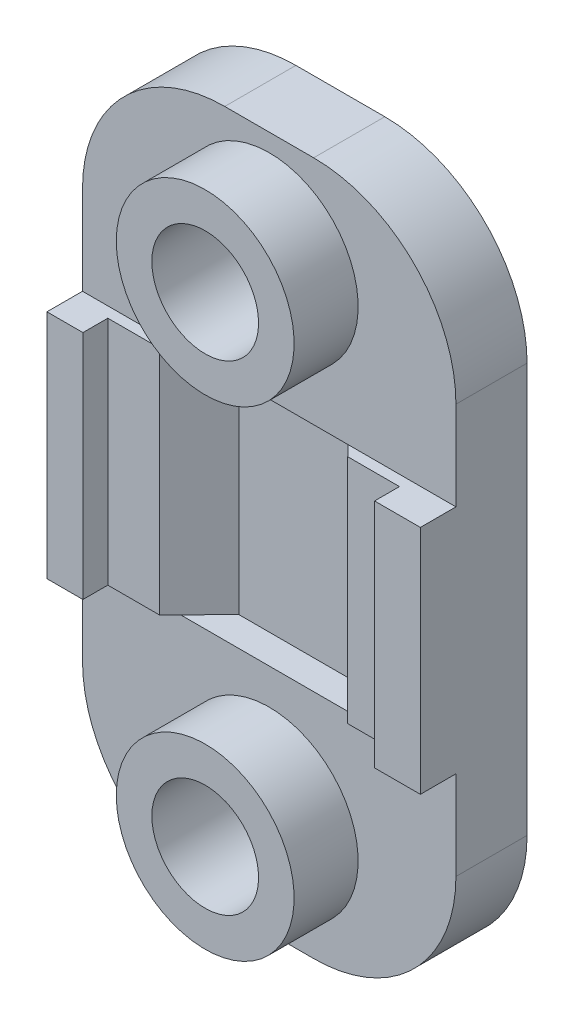
ISO-10303-21;
HEADER;
FILE_DESCRIPTION(('STEP AP214'),'2;1');
FILE_NAME('part.step','',(''),(''),'','','');
FILE_SCHEMA(('AUTOMOTIVE_DESIGN { 1 0 10303 214 1 1 1 1 }'));
ENDSEC;
DATA;
#1=APPLICATION_CONTEXT('core data for automotive mechanical design processes');
#2=APPLICATION_PROTOCOL_DEFINITION('international standard','automotive_design',2000,#1);
#3=PRODUCT_CONTEXT('',#1,'mechanical');
#4=PRODUCT('Part','Part','',(#3));
#5=PRODUCT_RELATED_PRODUCT_CATEGORY('part','',(#4));
#6=PRODUCT_DEFINITION_FORMATION('','',#4);
#7=PRODUCT_DEFINITION_CONTEXT('part definition',#1,'design');
#8=PRODUCT_DEFINITION('design','',#6,#7);
#9=PRODUCT_DEFINITION_SHAPE('','',#8);
#10=(LENGTH_UNIT() NAMED_UNIT(*) SI_UNIT(.MILLI.,.METRE.));
#11=(NAMED_UNIT(*) PLANE_ANGLE_UNIT() SI_UNIT($,.RADIAN.));
#12=(NAMED_UNIT(*) SI_UNIT($,.STERADIAN.) SOLID_ANGLE_UNIT());
#13=UNCERTAINTY_MEASURE_WITH_UNIT(LENGTH_MEASURE(1.E-05),#10,'distance_accuracy_value','');
#14=(GEOMETRIC_REPRESENTATION_CONTEXT(3) GLOBAL_UNCERTAINTY_ASSIGNED_CONTEXT((#13)) GLOBAL_UNIT_ASSIGNED_CONTEXT((#10,
#11,#12)) REPRESENTATION_CONTEXT('',''));
#15=CARTESIAN_POINT('',(0.,0.,0.));
#16=DIRECTION('',(0.,0.,1.));
#17=DIRECTION('',(1.,0.,0.));
#18=AXIS2_PLACEMENT_3D('',#15,#16,#17);
#19=CARTESIAN_POINT('',(0.,13.,0.));
#20=DIRECTION('',(0.,-1.,0.));
#21=DIRECTION('',(0.,0.,-1.));
#22=AXIS2_PLACEMENT_3D('',#19,#20,#21);
#23=PLANE('',#22);
#24=DIRECTION('',(1.,0.,0.));
#25=VECTOR('',#24,1.);
#26=CARTESIAN_POINT('',(0.,13.,0.));
#27=LINE('',#26,#25);
#28=CARTESIAN_POINT('',(-10.5,13.,0.));
#29=VERTEX_POINT('',#28);
#30=CARTESIAN_POINT('',(-4.97955941976815,13.,0.));
#31=VERTEX_POINT('',#30);
#32=EDGE_CURVE('E277',#29,#31,#27,.T.);
#33=ORIENTED_EDGE('',*,*,#32,.F.);
#34=DIRECTION('',(0.,0.,1.));
#35=VECTOR('',#34,1.);
#36=CARTESIAN_POINT('',(-10.5,13.,2.));
#37=LINE('',#36,#35);
#38=CARTESIAN_POINT('',(-10.5,13.,2.));
#39=VERTEX_POINT('',#38);
#40=EDGE_CURVE('E307',#29,#39,#37,.T.);
#41=ORIENTED_EDGE('',*,*,#40,.T.);
#42=DIRECTION('',(1.,0.,0.));
#43=VECTOR('',#42,1.);
#44=CARTESIAN_POINT('',(-8.47617523550108,13.,2.));
#45=LINE('',#44,#43);
#46=CARTESIAN_POINT('',(-8.47617523550108,13.,2.));
#47=VERTEX_POINT('',#46);
#48=EDGE_CURVE('E310',#39,#47,#45,.T.);
#49=ORIENTED_EDGE('',*,*,#48,.T.);
#50=DIRECTION('',(0.,0.,-1.));
#51=VECTOR('',#50,1.);
#52=CARTESIAN_POINT('',(-8.47617523550108,13.,0.599999999999971));
#53=LINE('',#52,#51);
#54=CARTESIAN_POINT('',(-8.47617523550108,13.,0.599999999999971));
#55=VERTEX_POINT('',#54);
#56=EDGE_CURVE('E313',#47,#55,#53,.T.);
#57=ORIENTED_EDGE('',*,*,#56,.T.);
#58=DIRECTION('',(1.,0.,0.));
#59=VECTOR('',#58,1.);
#60=CARTESIAN_POINT('',(-5.56844830865702,13.,0.599999999999971));
#61=LINE('',#60,#59);
#62=CARTESIAN_POINT('',(-5.56844830865702,13.,0.599999999999971));
#63=VERTEX_POINT('',#62);
#64=EDGE_CURVE('E316',#55,#63,#61,.T.);
#65=ORIENTED_EDGE('',*,*,#64,.T.);
#66=DIRECTION('',(0.700467716482401,0.,-0.713684088491491));
#67=VECTOR('',#66,1.);
#68=CARTESIAN_POINT('',(-3.36011497532369,13.,-1.64999999999999));
#69=LINE('',#68,#67);
#70=EDGE_CURVE('E320',#63,#31,#69,.T.);
#71=ORIENTED_EDGE('',*,*,#70,.T.);
#72=EDGE_LOOP('',(#33,#41,#49,#57,#65,#71));
#73=FACE_BOUND('',#72,.T.);
#74=ADVANCED_FACE('F59',(#73),#23,.F.);
#75=CARTESIAN_POINT('',(4.42720894876601,13.,0.));
#76=VERTEX_POINT('',#75);
#77=CARTESIAN_POINT('',(10.5,13.,0.));
#78=VERTEX_POINT('',#77);
#79=EDGE_CURVE('E235',#76,#78,#27,.T.);
#80=ORIENTED_EDGE('',*,*,#79,.F.);
#81=DIRECTION('',(0.700467716482409,0.,0.713684088491483));
#82=VECTOR('',#81,1.);
#83=CARTESIAN_POINT('',(5.01609783765481,13.,0.599999999999881));
#84=LINE('',#83,#82);
#85=CARTESIAN_POINT('',(5.01609783765481,13.,0.599999999999881));
#86=VERTEX_POINT('',#85);
#87=EDGE_CURVE('E328',#76,#86,#84,.T.);
#88=ORIENTED_EDGE('',*,*,#87,.T.);
#89=DIRECTION('',(1.,0.,0.));
#90=VECTOR('',#89,1.);
#91=CARTESIAN_POINT('',(7.9238247644989,13.,0.599999999999881));
#92=LINE('',#91,#90);
#93=CARTESIAN_POINT('',(7.9238247644989,13.,0.599999999999881));
#94=VERTEX_POINT('',#93);
#95=EDGE_CURVE('E333',#86,#94,#92,.T.);
#96=ORIENTED_EDGE('',*,*,#95,.T.);
#97=DIRECTION('',(0.,0.,1.));
#98=VECTOR('',#97,1.);
#99=CARTESIAN_POINT('',(7.9238247644989,13.,1.99999999999986));
#100=LINE('',#99,#98);
#101=CARTESIAN_POINT('',(7.9238247644989,13.,1.99999999999986));
#102=VERTEX_POINT('',#101);
#103=EDGE_CURVE('E336',#94,#102,#100,.T.);
#104=ORIENTED_EDGE('',*,*,#103,.T.);
#105=DIRECTION('',(1.,0.,0.));
#106=VECTOR('',#105,1.);
#107=CARTESIAN_POINT('',(10.5,13.,1.99999999999986));
#108=LINE('',#107,#106);
#109=CARTESIAN_POINT('',(10.5,13.,1.99999999999986));
#110=VERTEX_POINT('',#109);
#111=EDGE_CURVE('E299',#102,#110,#108,.T.);
#112=ORIENTED_EDGE('',*,*,#111,.T.);
#113=DIRECTION('',(0.,0.,-1.));
#114=VECTOR('',#113,1.);
#115=CARTESIAN_POINT('',(10.5,13.,-2.));
#116=LINE('',#115,#114);
#117=EDGE_CURVE('E303',#110,#78,#116,.T.);
#118=ORIENTED_EDGE('',*,*,#117,.T.);
#119=EDGE_LOOP('',(#80,#88,#96,#104,#112,#118));
#120=FACE_BOUND('',#119,.T.);
#121=ADVANCED_FACE('F487',(#120),#23,.F.);
#122=CARTESIAN_POINT('',(0.,0.,0.));
#123=DIRECTION('',(0.,-1.,0.));
#124=DIRECTION('',(0.,0.,-1.));
#125=AXIS2_PLACEMENT_3D('',#122,#123,#124);
#126=PLANE('',#125);
#127=DIRECTION('',(-1.,0.,0.));
#128=VECTOR('',#127,1.);
#129=CARTESIAN_POINT('',(0.,0.,0.));
#130=LINE('',#129,#128);
#131=CARTESIAN_POINT('',(10.5,0.,0.));
#132=VERTEX_POINT('',#131);
#133=CARTESIAN_POINT('',(4.42720894876601,0.,0.));
#134=VERTEX_POINT('',#133);
#135=EDGE_CURVE('E238',#132,#134,#130,.T.);
#136=ORIENTED_EDGE('',*,*,#135,.F.);
#137=DIRECTION('',(0.,0.,-1.));
#138=VECTOR('',#137,1.);
#139=CARTESIAN_POINT('',(10.5,0.,-2.));
#140=LINE('',#139,#138);
#141=CARTESIAN_POINT('',(10.5,0.,1.99999999999986));
#142=VERTEX_POINT('',#141);
#143=EDGE_CURVE('E223',#142,#132,#140,.T.);
#144=ORIENTED_EDGE('',*,*,#143,.F.);
#145=DIRECTION('',(1.,0.,0.));
#146=VECTOR('',#145,1.);
#147=CARTESIAN_POINT('',(10.5,0.,1.99999999999986));
#148=LINE('',#147,#146);
#149=CARTESIAN_POINT('',(7.9238247644989,0.,1.99999999999986));
#150=VERTEX_POINT('',#149);
#151=EDGE_CURVE('E298',#150,#142,#148,.T.);
#152=ORIENTED_EDGE('',*,*,#151,.F.);
#153=DIRECTION('',(0.,0.,1.));
#154=VECTOR('',#153,1.);
#155=CARTESIAN_POINT('',(7.9238247644989,0.,1.99999999999986));
#156=LINE('',#155,#154);
#157=CARTESIAN_POINT('',(7.9238247644989,0.,0.599999999999881));
#158=VERTEX_POINT('',#157);
#159=EDGE_CURVE('E304',#158,#150,#156,.T.);
#160=ORIENTED_EDGE('',*,*,#159,.F.);
#161=DIRECTION('',(1.,0.,0.));
#162=VECTOR('',#161,1.);
#163=CARTESIAN_POINT('',(7.9238247644989,0.,0.599999999999881));
#164=LINE('',#163,#162);
#165=CARTESIAN_POINT('',(5.01609783765481,0.,0.599999999999881));
#166=VERTEX_POINT('',#165);
#167=EDGE_CURVE('E366',#166,#158,#164,.T.);
#168=ORIENTED_EDGE('',*,*,#167,.F.);
#169=DIRECTION('',(0.700467716482409,0.,0.713684088491483));
#170=VECTOR('',#169,1.);
#171=CARTESIAN_POINT('',(5.01609783765481,0.,0.599999999999881));
#172=LINE('',#171,#170);
#173=EDGE_CURVE('E361',#134,#166,#172,.T.);
#174=ORIENTED_EDGE('',*,*,#173,.F.);
#175=EDGE_LOOP('',(#136,#144,#152,#160,#168,#174));
#176=FACE_BOUND('',#175,.T.);
#177=ADVANCED_FACE('F494',(#176),#126,.T.);
#178=CARTESIAN_POINT('',(10.5,13.,1.99999999999986));
#179=DIRECTION('',(0.,0.,-1.));
#180=DIRECTION('',(-1.,0.,0.));
#181=AXIS2_PLACEMENT_3D('',#178,#179,#180);
#182=PLANE('',#181);
#183=ORIENTED_EDGE('',*,*,#151,.T.);
#184=DIRECTION('',(0.,-1.,0.));
#185=VECTOR('',#184,1.);
#186=CARTESIAN_POINT('',(10.5,13.,1.99999999999986));
#187=LINE('',#186,#185);
#188=EDGE_CURVE('E236',#110,#142,#187,.T.);
#189=ORIENTED_EDGE('',*,*,#188,.F.);
#190=ORIENTED_EDGE('',*,*,#111,.F.);
#191=DIRECTION('',(0.,-1.,0.));
#192=VECTOR('',#191,1.);
#193=CARTESIAN_POINT('',(7.9238247644989,13.,1.99999999999986));
#194=LINE('',#193,#192);
#195=EDGE_CURVE('E339',#102,#150,#194,.T.);
#196=ORIENTED_EDGE('',*,*,#195,.T.);
#197=EDGE_LOOP('',(#183,#189,#190,#196));
#198=FACE_BOUND('',#197,.T.);
#199=ADVANCED_FACE('F536',(#198),#182,.F.);
#200=CARTESIAN_POINT('',(10.5,13.,-2.));
#201=DIRECTION('',(-1.,0.,0.));
#202=DIRECTION('',(0.,0.,1.));
#203=AXIS2_PLACEMENT_3D('',#200,#201,#202);
#204=PLANE('',#203);
#205=DIRECTION('',(0.,-1.,0.));
#206=VECTOR('',#205,1.);
#207=CARTESIAN_POINT('',(10.5,13.,-4.));
#208=LINE('',#207,#206);
#209=CARTESIAN_POINT('',(10.5,18.,-4.));
#210=VERTEX_POINT('',#209);
#211=CARTESIAN_POINT('',(10.5,-5.,-4.));
#212=VERTEX_POINT('',#211);
#213=EDGE_CURVE('E264',#210,#212,#208,.T.);
#214=ORIENTED_EDGE('',*,*,#213,.F.);
#215=DIRECTION('',(0.,0.,-1.));
#216=VECTOR('',#215,1.);
#217=CARTESIAN_POINT('',(10.5,18.,-2.));
#218=LINE('',#217,#216);
#219=CARTESIAN_POINT('',(10.5,18.,0.));
#220=VERTEX_POINT('',#219);
#221=EDGE_CURVE('E12',#210,#220,#218,.F.);
#222=ORIENTED_EDGE('',*,*,#221,.T.);
#223=DIRECTION('',(0.,1.,0.));
#224=VECTOR('',#223,1.);
#225=CARTESIAN_POINT('',(10.5,0.,0.));
#226=LINE('',#225,#224);
#227=EDGE_CURVE('E272',#78,#220,#226,.T.);
#228=ORIENTED_EDGE('',*,*,#227,.F.);
#229=ORIENTED_EDGE('',*,*,#117,.F.);
#230=ORIENTED_EDGE('',*,*,#188,.T.);
#231=ORIENTED_EDGE('',*,*,#143,.T.);
#232=DIRECTION('',(0.,-1.,0.));
#233=VECTOR('',#232,1.);
#234=CARTESIAN_POINT('',(10.5,0.,0.));
#235=LINE('',#234,#233);
#236=CARTESIAN_POINT('',(10.5,-5.,0.));
#237=VERTEX_POINT('',#236);
#238=EDGE_CURVE('E256',#132,#237,#235,.T.);
#239=ORIENTED_EDGE('',*,*,#238,.T.);
#240=DIRECTION('',(0.,0.,-1.));
#241=VECTOR('',#240,1.);
#242=CARTESIAN_POINT('',(10.5,-5.,-4.));
#243=LINE('',#242,#241);
#244=EDGE_CURVE('E68',#237,#212,#243,.T.);
#245=ORIENTED_EDGE('',*,*,#244,.T.);
#246=EDGE_LOOP('',(#214,#222,#228,#229,#230,#231,#239,#245));
#247=FACE_BOUND('',#246,.T.);
#248=ADVANCED_FACE('F453',(#247),#204,.F.);
#249=CARTESIAN_POINT('',(-10.5,13.,2.));
#250=DIRECTION('',(1.,0.,0.));
#251=DIRECTION('',(0.,0.,-1.));
#252=AXIS2_PLACEMENT_3D('',#249,#250,#251);
#253=PLANE('',#252);
#254=DIRECTION('',(0.,1.,0.));
#255=VECTOR('',#254,1.);
#256=CARTESIAN_POINT('',(-10.5,13.,-4.));
#257=LINE('',#256,#255);
#258=CARTESIAN_POINT('',(-10.5,-5.,-4.));
#259=VERTEX_POINT('',#258);
#260=CARTESIAN_POINT('',(-10.5,18.,-4.));
#261=VERTEX_POINT('',#260);
#262=EDGE_CURVE('E294',#259,#261,#257,.T.);
#263=ORIENTED_EDGE('',*,*,#262,.F.);
#264=DIRECTION('',(0.,0.,-1.));
#265=VECTOR('',#264,1.);
#266=CARTESIAN_POINT('',(-10.5,-5.,0.));
#267=LINE('',#266,#265);
#268=CARTESIAN_POINT('',(-10.5,-5.,0.));
#269=VERTEX_POINT('',#268);
#270=EDGE_CURVE('E242',#259,#269,#267,.F.);
#271=ORIENTED_EDGE('',*,*,#270,.T.);
#272=DIRECTION('',(0.,-1.,0.));
#273=VECTOR('',#272,1.);
#274=CARTESIAN_POINT('',(-10.5,0.,0.));
#275=LINE('',#274,#273);
#276=CARTESIAN_POINT('',(-10.5,0.,0.));
#277=VERTEX_POINT('',#276);
#278=EDGE_CURVE('E229',#277,#269,#275,.T.);
#279=ORIENTED_EDGE('',*,*,#278,.F.);
#280=DIRECTION('',(0.,0.,1.));
#281=VECTOR('',#280,1.);
#282=CARTESIAN_POINT('',(-10.5,0.,2.));
#283=LINE('',#282,#281);
#284=CARTESIAN_POINT('',(-10.5,0.,2.));
#285=VERTEX_POINT('',#284);
#286=EDGE_CURVE('E210',#277,#285,#283,.T.);
#287=ORIENTED_EDGE('',*,*,#286,.T.);
#288=DIRECTION('',(0.,-1.,0.));
#289=VECTOR('',#288,1.);
#290=CARTESIAN_POINT('',(-10.5,13.,2.));
#291=LINE('',#290,#289);
#292=EDGE_CURVE('E402',#39,#285,#291,.T.);
#293=ORIENTED_EDGE('',*,*,#292,.F.);
#294=ORIENTED_EDGE('',*,*,#40,.F.);
#295=DIRECTION('',(0.,1.,0.));
#296=VECTOR('',#295,1.);
#297=CARTESIAN_POINT('',(-10.5,0.,0.));
#298=LINE('',#297,#296);
#299=CARTESIAN_POINT('',(-10.5,18.,0.));
#300=VERTEX_POINT('',#299);
#301=EDGE_CURVE('E267',#29,#300,#298,.T.);
#302=ORIENTED_EDGE('',*,*,#301,.T.);
#303=DIRECTION('',(0.,0.,-1.));
#304=VECTOR('',#303,1.);
#305=CARTESIAN_POINT('',(-10.5,18.,2.));
#306=LINE('',#305,#304);
#307=EDGE_CURVE('E427',#300,#261,#306,.T.);
#308=ORIENTED_EDGE('',*,*,#307,.T.);
#309=EDGE_LOOP('',(#263,#271,#279,#287,#293,#294,#302,#308));
#310=FACE_BOUND('',#309,.T.);
#311=ADVANCED_FACE('F240',(#310),#253,.F.);
#312=CARTESIAN_POINT('',(-8.47617523550108,13.,2.));
#313=DIRECTION('',(0.,0.,-1.));
#314=DIRECTION('',(-1.,0.,0.));
#315=AXIS2_PLACEMENT_3D('',#312,#313,#314);
#316=PLANE('',#315);
#317=DIRECTION('',(1.,0.,0.));
#318=VECTOR('',#317,1.);
#319=CARTESIAN_POINT('',(-8.47617523550108,0.,2.));
#320=LINE('',#319,#318);
#321=CARTESIAN_POINT('',(-8.47617523550108,0.,2.));
#322=VERTEX_POINT('',#321);
#323=EDGE_CURVE('E217',#285,#322,#320,.T.);
#324=ORIENTED_EDGE('',*,*,#323,.T.);
#325=DIRECTION('',(0.,-1.,0.));
#326=VECTOR('',#325,1.);
#327=CARTESIAN_POINT('',(-8.47617523550108,13.,2.));
#328=LINE('',#327,#326);
#329=EDGE_CURVE('E398',#47,#322,#328,.T.);
#330=ORIENTED_EDGE('',*,*,#329,.F.);
#331=ORIENTED_EDGE('',*,*,#48,.F.);
#332=ORIENTED_EDGE('',*,*,#292,.T.);
#333=EDGE_LOOP('',(#324,#330,#331,#332));
#334=FACE_BOUND('',#333,.T.);
#335=ADVANCED_FACE('F527',(#334),#316,.F.);
#336=CARTESIAN_POINT('',(-8.47617523550108,13.,0.599999999999971));
#337=DIRECTION('',(-1.,0.,0.));
#338=DIRECTION('',(0.,0.,1.));
#339=AXIS2_PLACEMENT_3D('',#336,#337,#338);
#340=PLANE('',#339);
#341=DIRECTION('',(0.,0.,-1.));
#342=VECTOR('',#341,1.);
#343=CARTESIAN_POINT('',(-8.47617523550108,0.,0.599999999999971));
#344=LINE('',#343,#342);
#345=CARTESIAN_POINT('',(-8.47617523550108,0.,0.599999999999971));
#346=VERTEX_POINT('',#345);
#347=EDGE_CURVE('E348',#322,#346,#344,.T.);
#348=ORIENTED_EDGE('',*,*,#347,.T.);
#349=DIRECTION('',(0.,-1.,0.));
#350=VECTOR('',#349,1.);
#351=CARTESIAN_POINT('',(-8.47617523550108,13.,0.599999999999971));
#352=LINE('',#351,#350);
#353=EDGE_CURVE('E394',#55,#346,#352,.T.);
#354=ORIENTED_EDGE('',*,*,#353,.F.);
#355=ORIENTED_EDGE('',*,*,#56,.F.);
#356=ORIENTED_EDGE('',*,*,#329,.T.);
#357=EDGE_LOOP('',(#348,#354,#355,#356));
#358=FACE_BOUND('',#357,.T.);
#359=ADVANCED_FACE('F523',(#358),#340,.F.);
#360=CARTESIAN_POINT('',(-5.56844830865702,13.,0.599999999999971));
#361=DIRECTION('',(0.,0.,-1.));
#362=DIRECTION('',(-1.,0.,0.));
#363=AXIS2_PLACEMENT_3D('',#360,#361,#362);
#364=PLANE('',#363);
#365=DIRECTION('',(1.,0.,0.));
#366=VECTOR('',#365,1.);
#367=CARTESIAN_POINT('',(-5.56844830865702,0.,0.599999999999971));
#368=LINE('',#367,#366);
#369=CARTESIAN_POINT('',(-5.56844830865702,0.,0.599999999999971));
#370=VERTEX_POINT('',#369);
#371=EDGE_CURVE('E351',#346,#370,#368,.T.);
#372=ORIENTED_EDGE('',*,*,#371,.T.);
#373=DIRECTION('',(0.,-1.,0.));
#374=VECTOR('',#373,1.);
#375=CARTESIAN_POINT('',(-5.56844830865702,13.,0.599999999999971));
#376=LINE('',#375,#374);
#377=EDGE_CURVE('E390',#63,#370,#376,.T.);
#378=ORIENTED_EDGE('',*,*,#377,.F.);
#379=ORIENTED_EDGE('',*,*,#64,.F.);
#380=ORIENTED_EDGE('',*,*,#353,.T.);
#381=EDGE_LOOP('',(#372,#378,#379,#380));
#382=FACE_BOUND('',#381,.T.);
#383=ADVANCED_FACE('F519',(#382),#364,.F.);
#384=CARTESIAN_POINT('',(-3.36011497532369,13.,-1.64999999999999));
#385=DIRECTION('',(-0.713684088491491,0.,-0.700467716482401));
#386=DIRECTION('',(-0.700467716482401,0.,0.713684088491491));
#387=AXIS2_PLACEMENT_3D('',#384,#385,#386);
#388=PLANE('',#387);
#389=DIRECTION('',(0.700467716482401,0.,-0.713684088491491));
#390=VECTOR('',#389,1.);
#391=CARTESIAN_POINT('',(-3.36011497532369,0.,-1.64999999999999));
#392=LINE('',#391,#390);
#393=CARTESIAN_POINT('',(-4.97955941976815,0.,0.));
#394=VERTEX_POINT('',#393);
#395=EDGE_CURVE('E355',#370,#394,#392,.T.);
#396=ORIENTED_EDGE('',*,*,#395,.T.);
#397=CARTESIAN_POINT('',(-3.36011497532369,0.,-1.64999999999999));
#398=VERTEX_POINT('',#397);
#399=EDGE_CURVE('E354',#394,#398,#392,.T.);
#400=ORIENTED_EDGE('',*,*,#399,.T.);
#401=DIRECTION('',(0.,-1.,0.));
#402=VECTOR('',#401,1.);
#403=CARTESIAN_POINT('',(-3.36011497532369,13.,-1.64999999999999));
#404=LINE('',#403,#402);
#405=CARTESIAN_POINT('',(-3.36011497532369,13.,-1.64999999999999));
#406=VERTEX_POINT('',#405);
#407=EDGE_CURVE('E386',#406,#398,#404,.T.);
#408=ORIENTED_EDGE('',*,*,#407,.F.);
#409=EDGE_CURVE('E319',#31,#406,#69,.T.);
#410=ORIENTED_EDGE('',*,*,#409,.F.);
#411=ORIENTED_EDGE('',*,*,#70,.F.);
#412=ORIENTED_EDGE('',*,*,#377,.T.);
#413=EDGE_LOOP('',(#396,#400,#408,#410,#411,#412));
#414=FACE_BOUND('',#413,.T.);
#415=ADVANCED_FACE('F515',(#414),#388,.F.);
#416=CARTESIAN_POINT('',(2.80776450432151,13.,-1.64999999999999));
#417=DIRECTION('',(0.,0.,-1.));
#418=DIRECTION('',(-1.,0.,0.));
#419=AXIS2_PLACEMENT_3D('',#416,#417,#418);
#420=PLANE('',#419);
#421=DIRECTION('',(1.,0.,0.));
#422=VECTOR('',#421,1.);
#423=CARTESIAN_POINT('',(2.80776450432151,0.,-1.64999999999999));
#424=LINE('',#423,#422);
#425=CARTESIAN_POINT('',(2.80776450432151,0.,-1.64999999999999));
#426=VERTEX_POINT('',#425);
#427=EDGE_CURVE('E358',#398,#426,#424,.T.);
#428=ORIENTED_EDGE('',*,*,#427,.T.);
#429=DIRECTION('',(0.,-1.,0.));
#430=VECTOR('',#429,1.);
#431=CARTESIAN_POINT('',(2.80776450432151,13.,-1.64999999999999));
#432=LINE('',#431,#430);
#433=CARTESIAN_POINT('',(2.80776450432151,13.,-1.64999999999999));
#434=VERTEX_POINT('',#433);
#435=EDGE_CURVE('E382',#434,#426,#432,.T.);
#436=ORIENTED_EDGE('',*,*,#435,.F.);
#437=DIRECTION('',(1.,0.,0.));
#438=VECTOR('',#437,1.);
#439=CARTESIAN_POINT('',(2.80776450432151,13.,-1.64999999999999));
#440=LINE('',#439,#438);
#441=EDGE_CURVE('E324',#406,#434,#440,.T.);
#442=ORIENTED_EDGE('',*,*,#441,.F.);
#443=ORIENTED_EDGE('',*,*,#407,.T.);
#444=EDGE_LOOP('',(#428,#436,#442,#443));
#445=FACE_BOUND('',#444,.T.);
#446=ADVANCED_FACE('F511',(#445),#420,.F.);
#447=CARTESIAN_POINT('',(5.01609783765481,13.,0.599999999999881));
#448=DIRECTION('',(0.713684088491483,0.,-0.700467716482409));
#449=DIRECTION('',(-0.700467716482409,0.,-0.713684088491484));
#450=AXIS2_PLACEMENT_3D('',#447,#448,#449);
#451=PLANE('',#450);
#452=EDGE_CURVE('E362',#426,#134,#172,.T.);
#453=ORIENTED_EDGE('',*,*,#452,.T.);
#454=ORIENTED_EDGE('',*,*,#173,.T.);
#455=DIRECTION('',(0.,-1.,0.));
#456=VECTOR('',#455,1.);
#457=CARTESIAN_POINT('',(5.01609783765481,13.,0.599999999999881));
#458=LINE('',#457,#456);
#459=EDGE_CURVE('E378',#86,#166,#458,.T.);
#460=ORIENTED_EDGE('',*,*,#459,.F.);
#461=ORIENTED_EDGE('',*,*,#87,.F.);
#462=EDGE_CURVE('E329',#434,#76,#84,.T.);
#463=ORIENTED_EDGE('',*,*,#462,.F.);
#464=ORIENTED_EDGE('',*,*,#435,.T.);
#465=EDGE_LOOP('',(#453,#454,#460,#461,#463,#464));
#466=FACE_BOUND('',#465,.T.);
#467=ADVANCED_FACE('F507',(#466),#451,.F.);
#468=CARTESIAN_POINT('',(7.9238247644989,13.,0.599999999999881));
#469=DIRECTION('',(0.,0.,-1.));
#470=DIRECTION('',(-1.,0.,0.));
#471=AXIS2_PLACEMENT_3D('',#468,#469,#470);
#472=PLANE('',#471);
#473=ORIENTED_EDGE('',*,*,#167,.T.);
#474=DIRECTION('',(0.,-1.,0.));
#475=VECTOR('',#474,1.);
#476=CARTESIAN_POINT('',(7.9238247644989,13.,0.599999999999881));
#477=LINE('',#476,#475);
#478=EDGE_CURVE('E374',#94,#158,#477,.T.);
#479=ORIENTED_EDGE('',*,*,#478,.F.);
#480=ORIENTED_EDGE('',*,*,#95,.F.);
#481=ORIENTED_EDGE('',*,*,#459,.T.);
#482=EDGE_LOOP('',(#473,#479,#480,#481));
#483=FACE_BOUND('',#482,.T.);
#484=ADVANCED_FACE('F503',(#483),#472,.F.);
#485=CARTESIAN_POINT('',(7.9238247644989,13.,1.99999999999986));
#486=DIRECTION('',(1.,0.,0.));
#487=DIRECTION('',(0.,0.,-1.));
#488=AXIS2_PLACEMENT_3D('',#485,#486,#487);
#489=PLANE('',#488);
#490=ORIENTED_EDGE('',*,*,#159,.T.);
#491=ORIENTED_EDGE('',*,*,#195,.F.);
#492=ORIENTED_EDGE('',*,*,#103,.F.);
#493=ORIENTED_EDGE('',*,*,#478,.T.);
#494=EDGE_LOOP('',(#490,#491,#492,#493));
#495=FACE_BOUND('',#494,.T.);
#496=ADVANCED_FACE('F501',(#495),#489,.F.);
#497=EDGE_CURVE('E214',#394,#277,#130,.T.);
#498=ORIENTED_EDGE('',*,*,#497,.F.);
#499=ORIENTED_EDGE('',*,*,#395,.F.);
#500=ORIENTED_EDGE('',*,*,#371,.F.);
#501=ORIENTED_EDGE('',*,*,#347,.F.);
#502=ORIENTED_EDGE('',*,*,#323,.F.);
#503=ORIENTED_EDGE('',*,*,#286,.F.);
#504=EDGE_LOOP('',(#498,#499,#500,#501,#502,#503));
#505=FACE_BOUND('',#504,.T.);
#506=ADVANCED_FACE('F212',(#505),#126,.T.);
#507=CARTESIAN_POINT('',(0.,0.,-4.));
#508=DIRECTION('',(0.,0.,-1.));
#509=DIRECTION('',(-1.,0.,0.));
#510=AXIS2_PLACEMENT_3D('',#507,#508,#509);
#511=PLANE('',#510);
#512=DIRECTION('',(-1.,0.,0.));
#513=VECTOR('',#512,1.);
#514=CARTESIAN_POINT('',(0.,-13.,-4.));
#515=LINE('',#514,#513);
#516=CARTESIAN_POINT('',(2.5,-13.,-4.));
#517=VERTEX_POINT('',#516);
#518=CARTESIAN_POINT('',(-2.5,-13.,-4.));
#519=VERTEX_POINT('',#518);
#520=EDGE_CURVE('E249',#517,#519,#515,.T.);
#521=ORIENTED_EDGE('',*,*,#520,.T.);
#522=CARTESIAN_POINT('',(-2.5,-5.,-4.));
#523=DIRECTION('',(0.,0.,-1.));
#524=DIRECTION('',(-1.,0.,0.));
#525=AXIS2_PLACEMENT_3D('',#522,#523,#524);
#526=CIRCLE('',#525,8.);
#527=EDGE_CURVE('E424',#519,#259,#526,.T.);
#528=ORIENTED_EDGE('',*,*,#527,.T.);
#529=ORIENTED_EDGE('',*,*,#262,.T.);
#530=CARTESIAN_POINT('',(-2.5,18.,-4.));
#531=DIRECTION('',(0.,0.,-1.));
#532=DIRECTION('',(-1.,0.,0.));
#533=AXIS2_PLACEMENT_3D('',#530,#531,#532);
#534=CIRCLE('',#533,8.);
#535=CARTESIAN_POINT('',(-2.5,26.,-4.));
#536=VERTEX_POINT('',#535);
#537=EDGE_CURVE('E421',#261,#536,#534,.T.);
#538=ORIENTED_EDGE('',*,*,#537,.T.);
#539=DIRECTION('',(-1.,0.,0.));
#540=VECTOR('',#539,1.);
#541=CARTESIAN_POINT('',(0.,26.,-4.));
#542=LINE('',#541,#540);
#543=CARTESIAN_POINT('',(2.5,26.,-4.));
#544=VERTEX_POINT('',#543);
#545=EDGE_CURVE('E284',#544,#536,#542,.T.);
#546=ORIENTED_EDGE('',*,*,#545,.F.);
#547=CARTESIAN_POINT('',(2.5,18.,-4.));
#548=DIRECTION('',(0.,0.,-1.));
#549=DIRECTION('',(-1.,0.,0.));
#550=AXIS2_PLACEMENT_3D('',#547,#548,#549);
#551=CIRCLE('',#550,8.);
#552=EDGE_CURVE('E418',#544,#210,#551,.T.);
#553=ORIENTED_EDGE('',*,*,#552,.T.);
#554=ORIENTED_EDGE('',*,*,#213,.T.);
#555=CARTESIAN_POINT('',(2.5,-5.,-4.));
#556=DIRECTION('',(0.,0.,-1.));
#557=DIRECTION('',(-1.,0.,0.));
#558=AXIS2_PLACEMENT_3D('',#555,#556,#557);
#559=CIRCLE('',#558,8.);
#560=EDGE_CURVE('E415',#212,#517,#559,.T.);
#561=ORIENTED_EDGE('',*,*,#560,.T.);
#562=EDGE_LOOP('',(#521,#528,#529,#538,#546,#553,#554,#561));
#563=FACE_BOUND('',#562,.T.);
#564=CARTESIAN_POINT('',(0.,-7.,-4.));
#565=DIRECTION('',(0.,0.,-1.));
#566=DIRECTION('',(-1.,0.,0.));
#567=AXIS2_PLACEMENT_3D('',#564,#565,#566);
#568=CIRCLE('',#567,3.);
#569=CARTESIAN_POINT('',(-3.,-7.,-4.));
#570=VERTEX_POINT('',#569);
#571=EDGE_CURVE('E244',#570,#570,#568,.F.);
#572=ORIENTED_EDGE('',*,*,#571,.T.);
#573=EDGE_LOOP('',(#572));
#574=FACE_BOUND('',#573,.T.);
#575=CARTESIAN_POINT('',(0.,20.,-4.));
#576=DIRECTION('',(0.,0.,-1.));
#577=DIRECTION('',(-1.,0.,0.));
#578=AXIS2_PLACEMENT_3D('',#575,#576,#577);
#579=CIRCLE('',#578,3.);
#580=CARTESIAN_POINT('',(-3.,20.,-4.));
#581=VERTEX_POINT('',#580);
#582=EDGE_CURVE('E273',#581,#581,#579,.T.);
#583=ORIENTED_EDGE('',*,*,#582,.F.);
#584=EDGE_LOOP('',(#583));
#585=FACE_BOUND('',#584,.T.);
#586=ADVANCED_FACE('F458',(#563,#574,#585),#511,.T.);
#587=CARTESIAN_POINT('',(0.,-13.,0.));
#588=DIRECTION('',(0.,-1.,0.));
#589=DIRECTION('',(0.,0.,-1.));
#590=AXIS2_PLACEMENT_3D('',#587,#588,#589);
#591=PLANE('',#590);
#592=DIRECTION('',(-1.,0.,0.));
#593=VECTOR('',#592,1.);
#594=CARTESIAN_POINT('',(0.,-13.,0.));
#595=LINE('',#594,#593);
#596=CARTESIAN_POINT('',(2.5,-13.,0.));
#597=VERTEX_POINT('',#596);
#598=CARTESIAN_POINT('',(-2.5,-13.,0.));
#599=VERTEX_POINT('',#598);
#600=EDGE_CURVE('E260',#597,#599,#595,.T.);
#601=ORIENTED_EDGE('',*,*,#600,.T.);
#602=DIRECTION('',(0.,0.,-1.));
#603=VECTOR('',#602,1.);
#604=CARTESIAN_POINT('',(-2.5,-13.,-4.));
#605=LINE('',#604,#603);
#606=EDGE_CURVE('E411',#599,#519,#605,.T.);
#607=ORIENTED_EDGE('',*,*,#606,.T.);
#608=ORIENTED_EDGE('',*,*,#520,.F.);
#609=DIRECTION('',(0.,0.,-1.));
#610=VECTOR('',#609,1.);
#611=CARTESIAN_POINT('',(2.5,-13.,0.));
#612=LINE('',#611,#610);
#613=EDGE_CURVE('E408',#517,#597,#612,.F.);
#614=ORIENTED_EDGE('',*,*,#613,.T.);
#615=EDGE_LOOP('',(#601,#607,#608,#614));
#616=FACE_BOUND('',#615,.T.);
#617=ADVANCED_FACE('F479',(#616),#591,.T.);
#618=CARTESIAN_POINT('',(0.,0.,0.));
#619=DIRECTION('',(0.,-1.,0.));
#620=DIRECTION('',(0.,0.,-1.));
#621=AXIS2_PLACEMENT_3D('',#618,#619,#620);
#622=PLANE('',#621);
#623=ORIENTED_EDGE('',*,*,#452,.F.);
#624=ORIENTED_EDGE('',*,*,#427,.F.);
#625=ORIENTED_EDGE('',*,*,#399,.F.);
#626=EDGE_CURVE('E233',#134,#394,#130,.T.);
#627=ORIENTED_EDGE('',*,*,#626,.F.);
#628=EDGE_LOOP('',(#623,#624,#625,#627));
#629=FACE_BOUND('',#628,.T.);
#630=ADVANCED_FACE('F655',(#629),#622,.F.);
#631=CARTESIAN_POINT('',(0.,-7.,0.));
#632=DIRECTION('',(0.,0.,-1.));
#633=DIRECTION('',(-1.,0.,0.));
#634=AXIS2_PLACEMENT_3D('',#631,#632,#633);
#635=CYLINDRICAL_SURFACE('',#634,3.);
#636=ORIENTED_EDGE('',*,*,#571,.F.);
#637=EDGE_LOOP('',(#636));
#638=FACE_BOUND('',#637,.T.);
#639=CARTESIAN_POINT('',(0.,-7.,3.6));
#640=DIRECTION('',(0.,0.,-1.));
#641=DIRECTION('',(-1.,0.,0.));
#642=AXIS2_PLACEMENT_3D('',#639,#640,#641);
#643=CIRCLE('',#642,3.);
#644=CARTESIAN_POINT('',(-3.,-7.,3.6));
#645=VERTEX_POINT('',#644);
#646=EDGE_CURVE('E917',#645,#645,#643,.T.);
#647=ORIENTED_EDGE('',*,*,#646,.F.);
#648=EDGE_LOOP('',(#647));
#649=FACE_BOUND('',#648,.T.);
#650=ADVANCED_FACE('F645',(#638,#649),#635,.F.);
#651=CARTESIAN_POINT('',(0.,0.,0.));
#652=DIRECTION('',(0.,0.,-1.));
#653=DIRECTION('',(-1.,0.,0.));
#654=AXIS2_PLACEMENT_3D('',#651,#652,#653);
#655=PLANE('',#654);
#656=CARTESIAN_POINT('',(0.,-7.,0.));
#657=DIRECTION('',(0.,0.,-1.));
#658=DIRECTION('',(-1.,0.,0.));
#659=AXIS2_PLACEMENT_3D('',#656,#657,#658);
#660=CIRCLE('',#659,5.);
#661=CARTESIAN_POINT('',(-5.,-7.,0.));
#662=VERTEX_POINT('',#661);
#663=EDGE_CURVE('E252',#662,#662,#660,.T.);
#664=ORIENTED_EDGE('',*,*,#663,.T.);
#665=EDGE_LOOP('',(#664));
#666=FACE_BOUND('',#665,.T.);
#667=ORIENTED_EDGE('',*,*,#278,.T.);
#668=CARTESIAN_POINT('',(-2.5,-5.,0.));
#669=DIRECTION('',(0.,0.,-1.));
#670=DIRECTION('',(-1.,0.,0.));
#671=AXIS2_PLACEMENT_3D('',#668,#669,#670);
#672=CIRCLE('',#671,8.);
#673=EDGE_CURVE('E436',#269,#599,#672,.F.);
#674=ORIENTED_EDGE('',*,*,#673,.T.);
#675=ORIENTED_EDGE('',*,*,#600,.F.);
#676=CARTESIAN_POINT('',(2.5,-5.,0.));
#677=DIRECTION('',(0.,0.,-1.));
#678=DIRECTION('',(-1.,0.,0.));
#679=AXIS2_PLACEMENT_3D('',#676,#677,#678);
#680=CIRCLE('',#679,8.);
#681=EDGE_CURVE('E433',#597,#237,#680,.F.);
#682=ORIENTED_EDGE('',*,*,#681,.T.);
#683=ORIENTED_EDGE('',*,*,#238,.F.);
#684=ORIENTED_EDGE('',*,*,#135,.T.);
#685=ORIENTED_EDGE('',*,*,#626,.T.);
#686=ORIENTED_EDGE('',*,*,#497,.T.);
#687=EDGE_LOOP('',(#667,#674,#675,#682,#683,#684,#685,#686));
#688=FACE_BOUND('',#687,.T.);
#689=ADVANCED_FACE('F228',(#666,#688),#655,.F.);
#690=CARTESIAN_POINT('',(0.,13.,0.));
#691=DIRECTION('',(0.,1.,0.));
#692=DIRECTION('',(0.,0.,1.));
#693=AXIS2_PLACEMENT_3D('',#690,#691,#692);
#694=PLANE('',#693);
#695=EDGE_CURVE('E276',#31,#76,#27,.T.);
#696=ORIENTED_EDGE('',*,*,#695,.F.);
#697=ORIENTED_EDGE('',*,*,#409,.T.);
#698=ORIENTED_EDGE('',*,*,#441,.T.);
#699=ORIENTED_EDGE('',*,*,#462,.T.);
#700=EDGE_LOOP('',(#696,#697,#698,#699));
#701=FACE_BOUND('',#700,.T.);
#702=ADVANCED_FACE('F628',(#701),#694,.F.);
#703=CARTESIAN_POINT('',(0.,26.,0.));
#704=DIRECTION('',(0.,-1.,0.));
#705=DIRECTION('',(0.,0.,-1.));
#706=AXIS2_PLACEMENT_3D('',#703,#704,#705);
#707=PLANE('',#706);
#708=ORIENTED_EDGE('',*,*,#545,.T.);
#709=DIRECTION('',(0.,0.,-1.));
#710=VECTOR('',#709,1.);
#711=CARTESIAN_POINT('',(-2.5,26.,0.));
#712=LINE('',#711,#710);
#713=CARTESIAN_POINT('',(-2.5,26.,0.));
#714=VERTEX_POINT('',#713);
#715=EDGE_CURVE('E81',#536,#714,#712,.F.);
#716=ORIENTED_EDGE('',*,*,#715,.T.);
#717=DIRECTION('',(-1.,0.,0.));
#718=VECTOR('',#717,1.);
#719=CARTESIAN_POINT('',(0.,26.,0.));
#720=LINE('',#719,#718);
#721=CARTESIAN_POINT('',(2.5,26.,0.));
#722=VERTEX_POINT('',#721);
#723=EDGE_CURVE('E269',#722,#714,#720,.T.);
#724=ORIENTED_EDGE('',*,*,#723,.F.);
#725=DIRECTION('',(0.,0.,-1.));
#726=VECTOR('',#725,1.);
#727=CARTESIAN_POINT('',(2.5,26.,0.));
#728=LINE('',#727,#726);
#729=EDGE_CURVE('E439',#722,#544,#728,.T.);
#730=ORIENTED_EDGE('',*,*,#729,.T.);
#731=EDGE_LOOP('',(#708,#716,#724,#730));
#732=FACE_BOUND('',#731,.T.);
#733=ADVANCED_FACE('F466',(#732),#707,.F.);
#734=CARTESIAN_POINT('',(0.,20.,0.));
#735=DIRECTION('',(0.,0.,-1.));
#736=DIRECTION('',(-1.,0.,0.));
#737=AXIS2_PLACEMENT_3D('',#734,#735,#736);
#738=CYLINDRICAL_SURFACE('',#737,3.);
#739=ORIENTED_EDGE('',*,*,#582,.T.);
#740=EDGE_LOOP('',(#739));
#741=FACE_BOUND('',#740,.T.);
#742=CARTESIAN_POINT('',(0.,20.,3.6));
#743=DIRECTION('',(0.,0.,-1.));
#744=DIRECTION('',(-1.,0.,0.));
#745=AXIS2_PLACEMENT_3D('',#742,#743,#744);
#746=CIRCLE('',#745,3.);
#747=CARTESIAN_POINT('',(-3.,20.,3.6));
#748=VERTEX_POINT('',#747);
#749=EDGE_CURVE('E907',#748,#748,#746,.T.);
#750=ORIENTED_EDGE('',*,*,#749,.F.);
#751=EDGE_LOOP('',(#750));
#752=FACE_BOUND('',#751,.T.);
#753=ADVANCED_FACE('F609',(#741,#752),#738,.F.);
#754=CARTESIAN_POINT('',(0.,0.,0.));
#755=DIRECTION('',(0.,0.,-1.));
#756=DIRECTION('',(-1.,0.,0.));
#757=AXIS2_PLACEMENT_3D('',#754,#755,#756);
#758=PLANE('',#757);
#759=CARTESIAN_POINT('',(0.,20.,0.));
#760=DIRECTION('',(0.,0.,-1.));
#761=DIRECTION('',(-1.,0.,0.));
#762=AXIS2_PLACEMENT_3D('',#759,#760,#761);
#763=CIRCLE('',#762,5.);
#764=CARTESIAN_POINT('',(-5.,20.,0.));
#765=VERTEX_POINT('',#764);
#766=EDGE_CURVE('E903',#765,#765,#763,.T.);
#767=ORIENTED_EDGE('',*,*,#766,.T.);
#768=EDGE_LOOP('',(#767));
#769=FACE_BOUND('',#768,.T.);
#770=ORIENTED_EDGE('',*,*,#723,.T.);
#771=CARTESIAN_POINT('',(-2.5,18.,0.));
#772=DIRECTION('',(0.,0.,-1.));
#773=DIRECTION('',(-1.,0.,0.));
#774=AXIS2_PLACEMENT_3D('',#771,#772,#773);
#775=CIRCLE('',#774,8.);
#776=EDGE_CURVE('E448',#714,#300,#775,.F.);
#777=ORIENTED_EDGE('',*,*,#776,.T.);
#778=ORIENTED_EDGE('',*,*,#301,.F.);
#779=ORIENTED_EDGE('',*,*,#32,.T.);
#780=ORIENTED_EDGE('',*,*,#695,.T.);
#781=ORIENTED_EDGE('',*,*,#79,.T.);
#782=ORIENTED_EDGE('',*,*,#227,.T.);
#783=CARTESIAN_POINT('',(2.5,18.,0.));
#784=DIRECTION('',(0.,0.,-1.));
#785=DIRECTION('',(-1.,0.,0.));
#786=AXIS2_PLACEMENT_3D('',#783,#784,#785);
#787=CIRCLE('',#786,8.);
#788=EDGE_CURVE('E445',#220,#722,#787,.F.);
#789=ORIENTED_EDGE('',*,*,#788,.T.);
#790=EDGE_LOOP('',(#770,#777,#778,#779,#780,#781,#782,#789));
#791=FACE_BOUND('',#790,.T.);
#792=ADVANCED_FACE('F469',(#769,#791),#758,.F.);
#793=CARTESIAN_POINT('',(0.,20.,3.6));
#794=DIRECTION('',(0.,0.,-1.));
#795=DIRECTION('',(-1.,0.,0.));
#796=AXIS2_PLACEMENT_3D('',#793,#794,#795);
#797=CYLINDRICAL_SURFACE('',#796,5.);
#798=CARTESIAN_POINT('',(0.,20.,3.6));
#799=DIRECTION('',(0.,0.,-1.));
#800=DIRECTION('',(-1.,0.,0.));
#801=AXIS2_PLACEMENT_3D('',#798,#799,#800);
#802=CIRCLE('',#801,5.);
#803=CARTESIAN_POINT('',(-5.,20.,3.6));
#804=VERTEX_POINT('',#803);
#805=EDGE_CURVE('E287',#804,#804,#802,.T.);
#806=ORIENTED_EDGE('',*,*,#805,.T.);
#807=EDGE_LOOP('',(#806));
#808=FACE_BOUND('',#807,.T.);
#809=ORIENTED_EDGE('',*,*,#766,.F.);
#810=EDGE_LOOP('',(#809));
#811=FACE_BOUND('',#810,.T.);
#812=ADVANCED_FACE('F592',(#808,#811),#797,.T.);
#813=CARTESIAN_POINT('',(0.,20.,3.6));
#814=DIRECTION('',(0.,0.,-1.));
#815=DIRECTION('',(-1.,0.,0.));
#816=AXIS2_PLACEMENT_3D('',#813,#814,#815);
#817=PLANE('',#816);
#818=ORIENTED_EDGE('',*,*,#749,.T.);
#819=EDGE_LOOP('',(#818));
#820=FACE_BOUND('',#819,.T.);
#821=ORIENTED_EDGE('',*,*,#805,.F.);
#822=EDGE_LOOP('',(#821));
#823=FACE_BOUND('',#822,.T.);
#824=ADVANCED_FACE('F582',(#820,#823),#817,.F.);
#825=CARTESIAN_POINT('',(0.,-7.,3.6));
#826=DIRECTION('',(0.,0.,-1.));
#827=DIRECTION('',(-1.,0.,0.));
#828=AXIS2_PLACEMENT_3D('',#825,#826,#827);
#829=CYLINDRICAL_SURFACE('',#828,5.);
#830=CARTESIAN_POINT('',(0.,-7.,3.6));
#831=DIRECTION('',(0.,0.,-1.));
#832=DIRECTION('',(-1.,0.,0.));
#833=AXIS2_PLACEMENT_3D('',#830,#831,#832);
#834=CIRCLE('',#833,5.);
#835=CARTESIAN_POINT('',(-5.,-7.,3.6));
#836=VERTEX_POINT('',#835);
#837=EDGE_CURVE('E911',#836,#836,#834,.T.);
#838=ORIENTED_EDGE('',*,*,#837,.T.);
#839=EDGE_LOOP('',(#838));
#840=FACE_BOUND('',#839,.T.);
#841=ORIENTED_EDGE('',*,*,#663,.F.);
#842=EDGE_LOOP('',(#841));
#843=FACE_BOUND('',#842,.T.);
#844=ADVANCED_FACE('F573',(#840,#843),#829,.T.);
#845=CARTESIAN_POINT('',(0.,-7.,3.6));
#846=DIRECTION('',(0.,0.,-1.));
#847=DIRECTION('',(-1.,0.,0.));
#848=AXIS2_PLACEMENT_3D('',#845,#846,#847);
#849=PLANE('',#848);
#850=ORIENTED_EDGE('',*,*,#646,.T.);
#851=EDGE_LOOP('',(#850));
#852=FACE_BOUND('',#851,.T.);
#853=ORIENTED_EDGE('',*,*,#837,.F.);
#854=EDGE_LOOP('',(#853));
#855=FACE_BOUND('',#854,.T.);
#856=ADVANCED_FACE('F542',(#852,#855),#849,.F.);
#857=CARTESIAN_POINT('',(-2.5,-5.,0.));
#858=DIRECTION('',(0.,0.,1.));
#859=DIRECTION('',(1.,0.,0.));
#860=AXIS2_PLACEMENT_3D('',#857,#858,#859);
#861=CYLINDRICAL_SURFACE('',#860,8.);
#862=ORIENTED_EDGE('',*,*,#673,.F.);
#863=ORIENTED_EDGE('',*,*,#270,.F.);
#864=ORIENTED_EDGE('',*,*,#527,.F.);
#865=ORIENTED_EDGE('',*,*,#606,.F.);
#866=EDGE_LOOP('',(#862,#863,#864,#865));
#867=FACE_BOUND('',#866,.T.);
#868=ADVANCED_FACE('F477',(#867),#861,.T.);
#869=CARTESIAN_POINT('',(-2.5,18.,2.));
#870=DIRECTION('',(0.,0.,-1.));
#871=DIRECTION('',(-1.,0.,0.));
#872=AXIS2_PLACEMENT_3D('',#869,#870,#871);
#873=CYLINDRICAL_SURFACE('',#872,8.);
#874=ORIENTED_EDGE('',*,*,#776,.F.);
#875=ORIENTED_EDGE('',*,*,#715,.F.);
#876=ORIENTED_EDGE('',*,*,#537,.F.);
#877=ORIENTED_EDGE('',*,*,#307,.F.);
#878=EDGE_LOOP('',(#874,#875,#876,#877));
#879=FACE_BOUND('',#878,.T.);
#880=ADVANCED_FACE('F473',(#879),#873,.T.);
#881=CARTESIAN_POINT('',(2.5,18.,0.));
#882=DIRECTION('',(0.,0.,-1.));
#883=DIRECTION('',(-1.,0.,0.));
#884=AXIS2_PLACEMENT_3D('',#881,#882,#883);
#885=CYLINDRICAL_SURFACE('',#884,8.);
#886=ORIENTED_EDGE('',*,*,#788,.F.);
#887=ORIENTED_EDGE('',*,*,#221,.F.);
#888=ORIENTED_EDGE('',*,*,#552,.F.);
#889=ORIENTED_EDGE('',*,*,#729,.F.);
#890=EDGE_LOOP('',(#886,#887,#888,#889));
#891=FACE_BOUND('',#890,.T.);
#892=ADVANCED_FACE('F465',(#891),#885,.T.);
#893=CARTESIAN_POINT('',(2.5,-5.,-2.));
#894=DIRECTION('',(0.,0.,1.));
#895=DIRECTION('',(1.,0.,0.));
#896=AXIS2_PLACEMENT_3D('',#893,#894,#895);
#897=CYLINDRICAL_SURFACE('',#896,8.);
#898=ORIENTED_EDGE('',*,*,#681,.F.);
#899=ORIENTED_EDGE('',*,*,#613,.F.);
#900=ORIENTED_EDGE('',*,*,#560,.F.);
#901=ORIENTED_EDGE('',*,*,#244,.F.);
#902=EDGE_LOOP('',(#898,#899,#900,#901));
#903=FACE_BOUND('',#902,.T.);
#904=ADVANCED_FACE('F61',(#903),#897,.T.);
#905=CLOSED_SHELL('',(#74,#121,#177,#199,#248,#311,#335,#359,#383,#415,#446,#467,#484,#496,#506,
#586,#617,#630,#650,#689,#702,#733,#753,#792,#812,#824,#844,#856,#868,#880,#892,#904));
#906=MANIFOLD_SOLID_BREP('B2',#905);
#907=ADVANCED_BREP_SHAPE_REPRESENTATION('',(#18,#906),#14);
#908=SHAPE_DEFINITION_REPRESENTATION(#9,#907);
ENDSEC;
END-ISO-10303-21;
